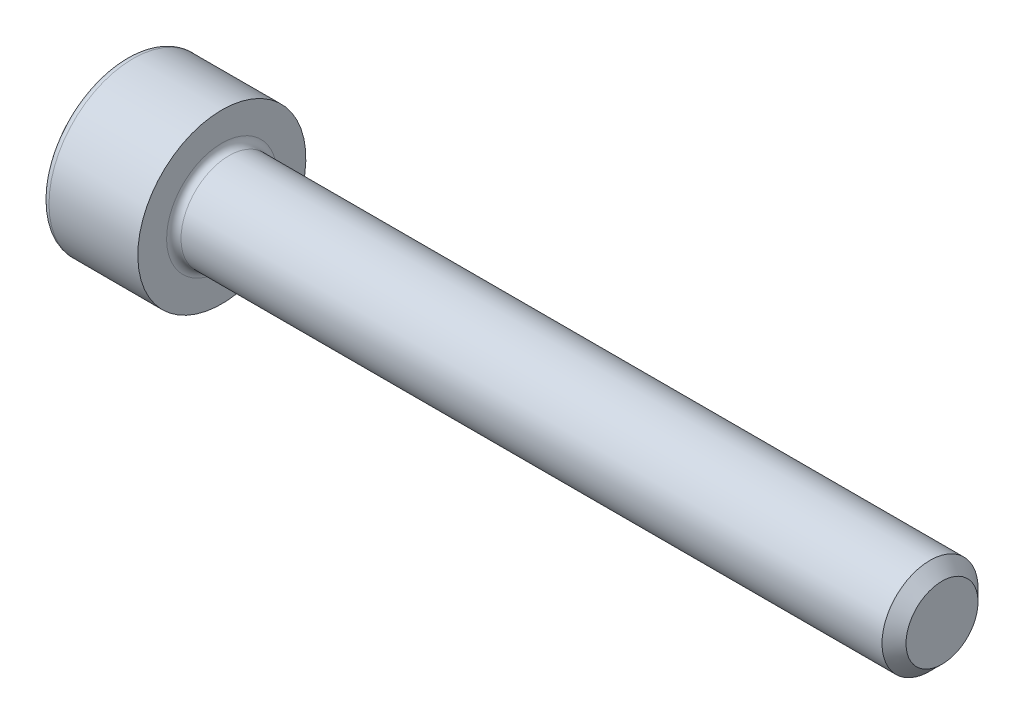
ISO-10303-21;
HEADER;
FILE_DESCRIPTION(('STEP AP214'),'2;1');
FILE_NAME('part.step','',(''),(''),'','','');
FILE_SCHEMA(('AUTOMOTIVE_DESIGN { 1 0 10303 214 1 1 1 1 }'));
ENDSEC;
DATA;
#1=APPLICATION_CONTEXT('core data for automotive mechanical design processes');
#2=APPLICATION_PROTOCOL_DEFINITION('international standard','automotive_design',2000,#1);
#3=PRODUCT_CONTEXT('',#1,'mechanical');
#4=PRODUCT('Part','Part','',(#3));
#5=PRODUCT_RELATED_PRODUCT_CATEGORY('part','',(#4));
#6=PRODUCT_DEFINITION_FORMATION('','',#4);
#7=PRODUCT_DEFINITION_CONTEXT('part definition',#1,'design');
#8=PRODUCT_DEFINITION('design','',#6,#7);
#9=PRODUCT_DEFINITION_SHAPE('','',#8);
#10=(LENGTH_UNIT() NAMED_UNIT(*) SI_UNIT(.MILLI.,.METRE.));
#11=(NAMED_UNIT(*) PLANE_ANGLE_UNIT() SI_UNIT($,.RADIAN.));
#12=(NAMED_UNIT(*) SI_UNIT($,.STERADIAN.) SOLID_ANGLE_UNIT());
#13=UNCERTAINTY_MEASURE_WITH_UNIT(LENGTH_MEASURE(1.E-05),#10,'distance_accuracy_value','');
#14=(GEOMETRIC_REPRESENTATION_CONTEXT(3) GLOBAL_UNCERTAINTY_ASSIGNED_CONTEXT((#13)) GLOBAL_UNIT_ASSIGNED_CONTEXT((#10,
#11,#12)) REPRESENTATION_CONTEXT('',''));
#15=CARTESIAN_POINT('',(0.,0.,0.));
#16=DIRECTION('',(0.,0.,1.));
#17=DIRECTION('',(1.,0.,0.));
#18=AXIS2_PLACEMENT_3D('',#15,#16,#17);
#19=CARTESIAN_POINT('',(0.,0.,0.));
#20=DIRECTION('',(-1.,0.,0.));
#21=DIRECTION('',(0.,-1.,0.));
#22=AXIS2_PLACEMENT_3D('',#19,#20,#21);
#23=PLANE('',#22);
#24=CARTESIAN_POINT('',(0.,0.,0.));
#25=DIRECTION('',(-1.,0.,0.));
#26=DIRECTION('',(0.,-1.,0.));
#27=AXIS2_PLACEMENT_3D('',#24,#25,#26);
#28=CIRCLE('',#27,3.2);
#29=CARTESIAN_POINT('',(0.,-3.2,0.));
#30=VERTEX_POINT('',#29);
#31=EDGE_CURVE('E159',#30,#30,#28,.T.);
#32=ORIENTED_EDGE('',*,*,#31,.T.);
#33=EDGE_LOOP('',(#32));
#34=FACE_BOUND('',#33,.T.);
#35=DIRECTION('',(0.,0.,-1.));
#36=VECTOR('',#35,1.);
#37=CARTESIAN_POINT('',(0.,2.,1.15470053837925));
#38=LINE('',#37,#36);
#39=CARTESIAN_POINT('',(0.,2.,1.15470053837925));
#40=VERTEX_POINT('',#39);
#41=CARTESIAN_POINT('',(0.,2.,-1.15470053837925));
#42=VERTEX_POINT('',#41);
#43=EDGE_CURVE('E55',#40,#42,#38,.T.);
#44=ORIENTED_EDGE('',*,*,#43,.F.);
#45=DIRECTION('',(0.,0.866025403784439,-0.5));
#46=VECTOR('',#45,1.);
#47=CARTESIAN_POINT('',(0.,0.,2.3094010767585));
#48=LINE('',#47,#46);
#49=CARTESIAN_POINT('',(0.,0.,2.3094010767585));
#50=VERTEX_POINT('',#49);
#51=EDGE_CURVE('E138',#50,#40,#48,.T.);
#52=ORIENTED_EDGE('',*,*,#51,.F.);
#53=DIRECTION('',(0.,0.866025403784438,0.5));
#54=VECTOR('',#53,1.);
#55=CARTESIAN_POINT('',(0.,-2.,1.15470053837925));
#56=LINE('',#55,#54);
#57=CARTESIAN_POINT('',(0.,-2.,1.15470053837925));
#58=VERTEX_POINT('',#57);
#59=EDGE_CURVE('E136',#58,#50,#56,.T.);
#60=ORIENTED_EDGE('',*,*,#59,.F.);
#61=DIRECTION('',(0.,0.,1.));
#62=VECTOR('',#61,1.);
#63=CARTESIAN_POINT('',(0.,-2.,-1.15470053837925));
#64=LINE('',#63,#62);
#65=CARTESIAN_POINT('',(0.,-2.,-1.15470053837925));
#66=VERTEX_POINT('',#65);
#67=EDGE_CURVE('E103',#66,#58,#64,.T.);
#68=ORIENTED_EDGE('',*,*,#67,.F.);
#69=DIRECTION('',(0.,-0.866025403784439,0.5));
#70=VECTOR('',#69,1.);
#71=CARTESIAN_POINT('',(0.,0.,-2.3094010767585));
#72=LINE('',#71,#70);
#73=CARTESIAN_POINT('',(0.,0.,-2.3094010767585));
#74=VERTEX_POINT('',#73);
#75=EDGE_CURVE('E132',#74,#66,#72,.T.);
#76=ORIENTED_EDGE('',*,*,#75,.F.);
#77=DIRECTION('',(0.,-0.866025403784439,-0.5));
#78=VECTOR('',#77,1.);
#79=CARTESIAN_POINT('',(0.,2.,-1.15470053837925));
#80=LINE('',#79,#78);
#81=EDGE_CURVE('E129',#42,#74,#80,.T.);
#82=ORIENTED_EDGE('',*,*,#81,.F.);
#83=EDGE_LOOP('',(#44,#52,#60,#68,#76,#82));
#84=FACE_BOUND('',#83,.T.);
#85=ADVANCED_FACE('F39',(#34,#84),#23,.T.);
#86=CARTESIAN_POINT('',(34.,0.,0.));
#87=DIRECTION('',(1.,0.,0.));
#88=DIRECTION('',(0.,1.,0.));
#89=AXIS2_PLACEMENT_3D('',#86,#87,#88);
#90=CYLINDRICAL_SURFACE('',#89,3.5);
#91=CARTESIAN_POINT('',(0.300000000000002,0.,0.));
#92=DIRECTION('',(-1.,0.,0.));
#93=DIRECTION('',(0.,-1.,0.));
#94=AXIS2_PLACEMENT_3D('',#91,#92,#93);
#95=CIRCLE('',#94,3.5);
#96=CARTESIAN_POINT('',(0.300000000000002,-3.5,0.));
#97=VERTEX_POINT('',#96);
#98=EDGE_CURVE('E156',#97,#97,#95,.F.);
#99=ORIENTED_EDGE('',*,*,#98,.T.);
#100=EDGE_LOOP('',(#99));
#101=FACE_BOUND('',#100,.T.);
#102=CARTESIAN_POINT('',(4.,0.,0.));
#103=DIRECTION('',(1.,0.,0.));
#104=DIRECTION('',(0.,1.,0.));
#105=AXIS2_PLACEMENT_3D('',#102,#103,#104);
#106=CIRCLE('',#105,3.5);
#107=CARTESIAN_POINT('',(4.,3.5,0.));
#108=VERTEX_POINT('',#107);
#109=EDGE_CURVE('E142',#108,#108,#106,.T.);
#110=ORIENTED_EDGE('',*,*,#109,.F.);
#111=EDGE_LOOP('',(#110));
#112=FACE_BOUND('',#111,.T.);
#113=ADVANCED_FACE('F176',(#101,#112),#90,.T.);
#114=CARTESIAN_POINT('',(4.,3.5,0.));
#115=DIRECTION('',(1.,0.,0.));
#116=DIRECTION('',(0.,1.,0.));
#117=AXIS2_PLACEMENT_3D('',#114,#115,#116);
#118=PLANE('',#117);
#119=CARTESIAN_POINT('',(4.,0.,0.));
#120=DIRECTION('',(1.,0.,0.));
#121=DIRECTION('',(0.,1.,0.));
#122=AXIS2_PLACEMENT_3D('',#119,#120,#121);
#123=CIRCLE('',#122,2.3);
#124=CARTESIAN_POINT('',(4.,2.3,0.));
#125=VERTEX_POINT('',#124);
#126=EDGE_CURVE('E153',#125,#125,#123,.F.);
#127=ORIENTED_EDGE('',*,*,#126,.T.);
#128=EDGE_LOOP('',(#127));
#129=FACE_BOUND('',#128,.T.);
#130=ORIENTED_EDGE('',*,*,#109,.T.);
#131=EDGE_LOOP('',(#130));
#132=FACE_BOUND('',#131,.T.);
#133=ADVANCED_FACE('F182',(#129,#132),#118,.T.);
#134=CARTESIAN_POINT('',(34.,0.,0.));
#135=DIRECTION('',(1.,0.,0.));
#136=DIRECTION('',(0.,1.,0.));
#137=AXIS2_PLACEMENT_3D('',#134,#135,#136);
#138=CYLINDRICAL_SURFACE('',#137,2.);
#139=CARTESIAN_POINT('',(33.5,0.,0.));
#140=DIRECTION('',(1.,0.,0.));
#141=DIRECTION('',(0.,1.,0.));
#142=AXIS2_PLACEMENT_3D('',#139,#140,#141);
#143=CIRCLE('',#142,2.);
#144=CARTESIAN_POINT('',(33.5,2.,0.));
#145=VERTEX_POINT('',#144);
#146=EDGE_CURVE('E11',#145,#145,#143,.F.);
#147=ORIENTED_EDGE('',*,*,#146,.T.);
#148=EDGE_LOOP('',(#147));
#149=FACE_BOUND('',#148,.T.);
#150=CARTESIAN_POINT('',(4.3,0.,0.));
#151=DIRECTION('',(1.,0.,0.));
#152=DIRECTION('',(0.,1.,0.));
#153=AXIS2_PLACEMENT_3D('',#150,#151,#152);
#154=CIRCLE('',#153,2.);
#155=CARTESIAN_POINT('',(4.3,2.,0.));
#156=VERTEX_POINT('',#155);
#157=EDGE_CURVE('E150',#156,#156,#154,.T.);
#158=ORIENTED_EDGE('',*,*,#157,.T.);
#159=EDGE_LOOP('',(#158));
#160=FACE_BOUND('',#159,.T.);
#161=ADVANCED_FACE('F199',(#149,#160),#138,.T.);
#162=CARTESIAN_POINT('',(34.,2.,0.));
#163=DIRECTION('',(1.,0.,0.));
#164=DIRECTION('',(0.,1.,0.));
#165=AXIS2_PLACEMENT_3D('',#162,#163,#164);
#166=PLANE('',#165);
#167=CARTESIAN_POINT('',(34.,0.,0.));
#168=DIRECTION('',(1.,0.,0.));
#169=DIRECTION('',(0.,1.,0.));
#170=AXIS2_PLACEMENT_3D('',#167,#168,#169);
#171=CIRCLE('',#170,1.49999999999999);
#172=CARTESIAN_POINT('',(34.,1.49999999999999,0.));
#173=VERTEX_POINT('',#172);
#174=EDGE_CURVE('E48',#173,#173,#171,.T.);
#175=ORIENTED_EDGE('',*,*,#174,.T.);
#176=EDGE_LOOP('',(#175));
#177=FACE_BOUND('',#176,.T.);
#178=ADVANCED_FACE('F164',(#177),#166,.T.);
#179=CARTESIAN_POINT('',(2.5,2.,1.15470053837925));
#180=DIRECTION('',(0.,1.,0.));
#181=DIRECTION('',(-1.,0.,0.));
#182=AXIS2_PLACEMENT_3D('',#179,#180,#181);
#183=PLANE('',#182);
#184=ORIENTED_EDGE('',*,*,#43,.T.);
#185=DIRECTION('',(-1.,0.,0.));
#186=VECTOR('',#185,1.);
#187=CARTESIAN_POINT('',(2.5,2.,-1.15470053837925));
#188=LINE('',#187,#186);
#189=CARTESIAN_POINT('',(2.5,2.,-1.15470053837925));
#190=VERTEX_POINT('',#189);
#191=EDGE_CURVE('E85',#190,#42,#188,.T.);
#192=ORIENTED_EDGE('',*,*,#191,.F.);
#193=DIRECTION('',(0.,0.,-1.));
#194=VECTOR('',#193,1.);
#195=CARTESIAN_POINT('',(2.5,2.,1.15470053837925));
#196=LINE('',#195,#194);
#197=CARTESIAN_POINT('',(2.5,2.,1.15470053837925));
#198=VERTEX_POINT('',#197);
#199=EDGE_CURVE('E140',#198,#190,#196,.T.);
#200=ORIENTED_EDGE('',*,*,#199,.F.);
#201=DIRECTION('',(-1.,0.,0.));
#202=VECTOR('',#201,1.);
#203=CARTESIAN_POINT('',(2.5,2.,1.15470053837925));
#204=LINE('',#203,#202);
#205=EDGE_CURVE('E63',#198,#40,#204,.T.);
#206=ORIENTED_EDGE('',*,*,#205,.T.);
#207=EDGE_LOOP('',(#184,#192,#200,#206));
#208=FACE_BOUND('',#207,.T.);
#209=ADVANCED_FACE('F207',(#208),#183,.F.);
#210=CARTESIAN_POINT('',(2.5,0.,2.3094010767585));
#211=DIRECTION('',(0.,0.5,0.866025403784439));
#212=DIRECTION('',(0.,-0.866025403784439,0.5));
#213=AXIS2_PLACEMENT_3D('',#210,#211,#212);
#214=PLANE('',#213);
#215=ORIENTED_EDGE('',*,*,#51,.T.);
#216=ORIENTED_EDGE('',*,*,#205,.F.);
#217=DIRECTION('',(0.,0.866025403784439,-0.5));
#218=VECTOR('',#217,1.);
#219=CARTESIAN_POINT('',(2.5,0.,2.3094010767585));
#220=LINE('',#219,#218);
#221=CARTESIAN_POINT('',(2.5,0.,2.3094010767585));
#222=VERTEX_POINT('',#221);
#223=EDGE_CURVE('E115',#222,#198,#220,.T.);
#224=ORIENTED_EDGE('',*,*,#223,.F.);
#225=DIRECTION('',(-1.,0.,0.));
#226=VECTOR('',#225,1.);
#227=CARTESIAN_POINT('',(2.5,0.,2.3094010767585));
#228=LINE('',#227,#226);
#229=EDGE_CURVE('E107',#222,#50,#228,.T.);
#230=ORIENTED_EDGE('',*,*,#229,.T.);
#231=EDGE_LOOP('',(#215,#216,#224,#230));
#232=FACE_BOUND('',#231,.T.);
#233=ADVANCED_FACE('F213',(#232),#214,.F.);
#234=CARTESIAN_POINT('',(2.5,-2.,1.15470053837925));
#235=DIRECTION('',(0.,-0.5,0.866025403784438));
#236=DIRECTION('',(0.,-0.866025403784439,-0.5));
#237=AXIS2_PLACEMENT_3D('',#234,#235,#236);
#238=PLANE('',#237);
#239=ORIENTED_EDGE('',*,*,#59,.T.);
#240=ORIENTED_EDGE('',*,*,#229,.F.);
#241=DIRECTION('',(0.,0.866025403784438,0.5));
#242=VECTOR('',#241,1.);
#243=CARTESIAN_POINT('',(2.5,-2.,1.15470053837925));
#244=LINE('',#243,#242);
#245=CARTESIAN_POINT('',(2.5,-2.,1.15470053837925));
#246=VERTEX_POINT('',#245);
#247=EDGE_CURVE('E111',#246,#222,#244,.T.);
#248=ORIENTED_EDGE('',*,*,#247,.F.);
#249=DIRECTION('',(-1.,0.,0.));
#250=VECTOR('',#249,1.);
#251=CARTESIAN_POINT('',(2.5,-2.,1.15470053837925));
#252=LINE('',#251,#250);
#253=EDGE_CURVE('E96',#246,#58,#252,.T.);
#254=ORIENTED_EDGE('',*,*,#253,.T.);
#255=EDGE_LOOP('',(#239,#240,#248,#254));
#256=FACE_BOUND('',#255,.T.);
#257=ADVANCED_FACE('F112',(#256),#238,.F.);
#258=CARTESIAN_POINT('',(2.5,-2.,-1.15470053837925));
#259=DIRECTION('',(0.,-1.,0.));
#260=DIRECTION('',(0.,0.,-1.));
#261=AXIS2_PLACEMENT_3D('',#258,#259,#260);
#262=PLANE('',#261);
#263=ORIENTED_EDGE('',*,*,#67,.T.);
#264=ORIENTED_EDGE('',*,*,#253,.F.);
#265=DIRECTION('',(0.,0.,1.));
#266=VECTOR('',#265,1.);
#267=CARTESIAN_POINT('',(2.5,-2.,-1.15470053837925));
#268=LINE('',#267,#266);
#269=CARTESIAN_POINT('',(2.5,-2.,-1.15470053837925));
#270=VERTEX_POINT('',#269);
#271=EDGE_CURVE('E100',#270,#246,#268,.T.);
#272=ORIENTED_EDGE('',*,*,#271,.F.);
#273=DIRECTION('',(-1.,0.,0.));
#274=VECTOR('',#273,1.);
#275=CARTESIAN_POINT('',(2.5,-2.,-1.15470053837925));
#276=LINE('',#275,#274);
#277=EDGE_CURVE('E108',#270,#66,#276,.T.);
#278=ORIENTED_EDGE('',*,*,#277,.T.);
#279=EDGE_LOOP('',(#263,#264,#272,#278));
#280=FACE_BOUND('',#279,.T.);
#281=ADVANCED_FACE('F98',(#280),#262,.F.);
#282=CARTESIAN_POINT('',(2.5,0.,-2.3094010767585));
#283=DIRECTION('',(0.,-0.5,-0.866025403784439));
#284=DIRECTION('',(0.,0.866025403784439,-0.5));
#285=AXIS2_PLACEMENT_3D('',#282,#283,#284);
#286=PLANE('',#285);
#287=ORIENTED_EDGE('',*,*,#75,.T.);
#288=ORIENTED_EDGE('',*,*,#277,.F.);
#289=DIRECTION('',(0.,-0.866025403784439,0.5));
#290=VECTOR('',#289,1.);
#291=CARTESIAN_POINT('',(2.5,0.,-2.3094010767585));
#292=LINE('',#291,#290);
#293=CARTESIAN_POINT('',(2.5,0.,-2.3094010767585));
#294=VERTEX_POINT('',#293);
#295=EDGE_CURVE('E121',#294,#270,#292,.T.);
#296=ORIENTED_EDGE('',*,*,#295,.F.);
#297=DIRECTION('',(-1.,0.,0.));
#298=VECTOR('',#297,1.);
#299=CARTESIAN_POINT('',(2.5,0.,-2.3094010767585));
#300=LINE('',#299,#298);
#301=EDGE_CURVE('E145',#294,#74,#300,.T.);
#302=ORIENTED_EDGE('',*,*,#301,.T.);
#303=EDGE_LOOP('',(#287,#288,#296,#302));
#304=FACE_BOUND('',#303,.T.);
#305=ADVANCED_FACE('F216',(#304),#286,.F.);
#306=CARTESIAN_POINT('',(2.5,2.,-1.15470053837925));
#307=DIRECTION('',(0.,0.5,-0.866025403784439));
#308=DIRECTION('',(0.,0.866025403784439,0.5));
#309=AXIS2_PLACEMENT_3D('',#306,#307,#308);
#310=PLANE('',#309);
#311=ORIENTED_EDGE('',*,*,#81,.T.);
#312=ORIENTED_EDGE('',*,*,#301,.F.);
#313=DIRECTION('',(0.,-0.866025403784439,-0.5));
#314=VECTOR('',#313,1.);
#315=CARTESIAN_POINT('',(2.5,2.,-1.15470053837925));
#316=LINE('',#315,#314);
#317=EDGE_CURVE('E123',#190,#294,#316,.T.);
#318=ORIENTED_EDGE('',*,*,#317,.F.);
#319=ORIENTED_EDGE('',*,*,#191,.T.);
#320=EDGE_LOOP('',(#311,#312,#318,#319));
#321=FACE_BOUND('',#320,.T.);
#322=ADVANCED_FACE('F193',(#321),#310,.F.);
#323=CARTESIAN_POINT('',(2.5,0.,0.));
#324=DIRECTION('',(-1.,0.,0.));
#325=DIRECTION('',(0.,-1.,0.));
#326=AXIS2_PLACEMENT_3D('',#323,#324,#325);
#327=PLANE('',#326);
#328=ORIENTED_EDGE('',*,*,#199,.T.);
#329=ORIENTED_EDGE('',*,*,#317,.T.);
#330=ORIENTED_EDGE('',*,*,#295,.T.);
#331=ORIENTED_EDGE('',*,*,#271,.T.);
#332=ORIENTED_EDGE('',*,*,#247,.T.);
#333=ORIENTED_EDGE('',*,*,#223,.T.);
#334=EDGE_LOOP('',(#328,#329,#330,#331,#332,#333));
#335=FACE_BOUND('',#334,.T.);
#336=ADVANCED_FACE('F118',(#335),#327,.T.);
#337=CARTESIAN_POINT('',(4.3,0.,0.));
#338=DIRECTION('',(1.,0.,0.));
#339=DIRECTION('',(0.,1.,0.));
#340=AXIS2_PLACEMENT_3D('',#337,#338,#339);
#341=TOROIDAL_SURFACE('',#340,2.3,0.3);
#342=ORIENTED_EDGE('',*,*,#126,.F.);
#343=EDGE_LOOP('',(#342));
#344=FACE_BOUND('',#343,.T.);
#345=ORIENTED_EDGE('',*,*,#157,.F.);
#346=EDGE_LOOP('',(#345));
#347=FACE_BOUND('',#346,.T.);
#348=ADVANCED_FACE('F172',(#344,#347),#341,.F.);
#349=CARTESIAN_POINT('',(0.300000000000002,0.,0.));
#350=DIRECTION('',(-1.,0.,0.));
#351=DIRECTION('',(0.,-1.,0.));
#352=AXIS2_PLACEMENT_3D('',#349,#350,#351);
#353=TOROIDAL_SURFACE('',#352,3.2,0.3);
#354=ORIENTED_EDGE('',*,*,#31,.F.);
#355=EDGE_LOOP('',(#354));
#356=FACE_BOUND('',#355,.T.);
#357=ORIENTED_EDGE('',*,*,#98,.F.);
#358=EDGE_LOOP('',(#357));
#359=FACE_BOUND('',#358,.T.);
#360=ADVANCED_FACE('F167',(#356,#359),#353,.T.);
#361=CARTESIAN_POINT('',(34.,0.,0.));
#362=DIRECTION('',(-1.,0.,0.));
#363=DIRECTION('',(0.,-1.,0.));
#364=AXIS2_PLACEMENT_3D('',#361,#362,#363);
#365=CONICAL_SURFACE('',#364,1.49999999999999,0.785398163397454);
#366=ORIENTED_EDGE('',*,*,#146,.F.);
#367=EDGE_LOOP('',(#366));
#368=FACE_BOUND('',#367,.T.);
#369=ORIENTED_EDGE('',*,*,#174,.F.);
#370=EDGE_LOOP('',(#369));
#371=FACE_BOUND('',#370,.T.);
#372=ADVANCED_FACE('F42',(#368,#371),#365,.T.);
#373=CLOSED_SHELL('',(#85,#113,#133,#161,#178,#209,#233,#257,#281,#305,#322,#336,#348,#360,#372));
#374=MANIFOLD_SOLID_BREP('B2',#373);
#375=ADVANCED_BREP_SHAPE_REPRESENTATION('',(#18,#374),#14);
#376=SHAPE_DEFINITION_REPRESENTATION(#9,#375);
ENDSEC;
END-ISO-10303-21;
